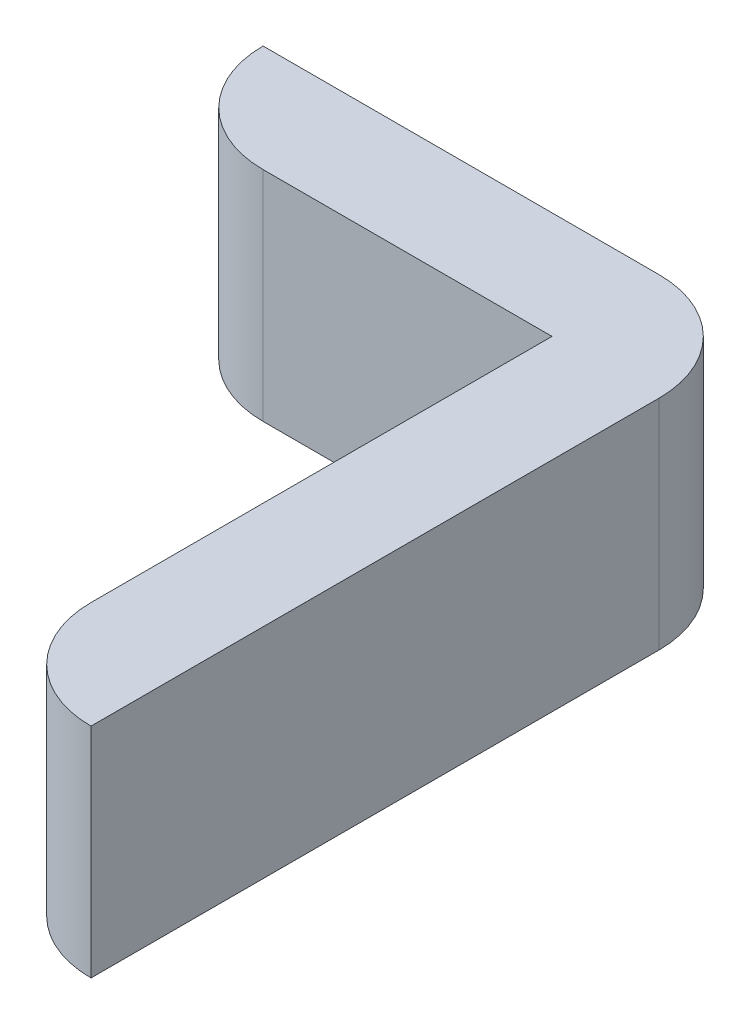
ISO-10303-21;
HEADER;
FILE_DESCRIPTION(('STEP AP214'),'2;1');
FILE_NAME('part.step','',(''),(''),'','','');
FILE_SCHEMA(('AUTOMOTIVE_DESIGN { 1 0 10303 214 1 1 1 1 }'));
ENDSEC;
DATA;
#1=APPLICATION_CONTEXT('core data for automotive mechanical design processes');
#2=APPLICATION_PROTOCOL_DEFINITION('international standard','automotive_design',2000,#1);
#3=PRODUCT_CONTEXT('',#1,'mechanical');
#4=PRODUCT('Part','Part','',(#3));
#5=PRODUCT_RELATED_PRODUCT_CATEGORY('part','',(#4));
#6=PRODUCT_DEFINITION_FORMATION('','',#4);
#7=PRODUCT_DEFINITION_CONTEXT('part definition',#1,'design');
#8=PRODUCT_DEFINITION('design','',#6,#7);
#9=PRODUCT_DEFINITION_SHAPE('','',#8);
#10=(LENGTH_UNIT() NAMED_UNIT(*) SI_UNIT(.MILLI.,.METRE.));
#11=(NAMED_UNIT(*) PLANE_ANGLE_UNIT() SI_UNIT($,.RADIAN.));
#12=(NAMED_UNIT(*) SI_UNIT($,.STERADIAN.) SOLID_ANGLE_UNIT());
#13=UNCERTAINTY_MEASURE_WITH_UNIT(LENGTH_MEASURE(1.E-05),#10,'distance_accuracy_value','');
#14=(GEOMETRIC_REPRESENTATION_CONTEXT(3) GLOBAL_UNCERTAINTY_ASSIGNED_CONTEXT((#13)) GLOBAL_UNIT_ASSIGNED_CONTEXT((#10,
#11,#12)) REPRESENTATION_CONTEXT('',''));
#15=CARTESIAN_POINT('',(0.,0.,0.));
#16=DIRECTION('',(0.,0.,1.));
#17=DIRECTION('',(1.,0.,0.));
#18=AXIS2_PLACEMENT_3D('',#15,#16,#17);
#19=CARTESIAN_POINT('',(9.275,7.8748,0.));
#20=DIRECTION('',(0.,-1.,0.));
#21=DIRECTION('',(0.,0.,-1.));
#22=AXIS2_PLACEMENT_3D('',#19,#20,#21);
#23=PLANE('',#22);
#24=DIRECTION('',(-1.,0.,0.));
#25=VECTOR('',#24,1.);
#26=CARTESIAN_POINT('',(9.525,7.8748,0.25));
#27=LINE('',#26,#25);
#28=CARTESIAN_POINT('',(9.525,7.8748,0.25));
#29=VERTEX_POINT('',#28);
#30=CARTESIAN_POINT('',(10.2,7.8748,0.25));
#31=VERTEX_POINT('',#30);
#32=EDGE_CURVE('E102',#29,#31,#27,.F.);
#33=ORIENTED_EDGE('',*,*,#32,.T.);
#34=DIRECTION('',(0.,0.,-1.));
#35=VECTOR('',#34,1.);
#36=CARTESIAN_POINT('',(10.2,7.8748,0.25));
#37=LINE('',#36,#35);
#38=CARTESIAN_POINT('',(10.2,7.8748,1.327));
#39=VERTEX_POINT('',#38);
#40=EDGE_CURVE('E108',#31,#39,#37,.F.);
#41=ORIENTED_EDGE('',*,*,#40,.T.);
#42=CARTESIAN_POINT('',(10.45,7.8748,1.327));
#43=DIRECTION('',(0.,-1.,0.));
#44=DIRECTION('',(0.,0.,-1.));
#45=AXIS2_PLACEMENT_3D('',#42,#43,#44);
#46=CIRCLE('',#45,0.25);
#47=CARTESIAN_POINT('',(10.45,7.8748,1.577));
#48=VERTEX_POINT('',#47);
#49=EDGE_CURVE('E80',#48,#39,#46,.T.);
#50=ORIENTED_EDGE('',*,*,#49,.F.);
#51=DIRECTION('',(0.,0.,1.));
#52=VECTOR('',#51,1.);
#53=CARTESIAN_POINT('',(10.45,7.8748,1.577));
#54=LINE('',#53,#52);
#55=CARTESIAN_POINT('',(10.45,7.8748,0.25));
#56=VERTEX_POINT('',#55);
#57=EDGE_CURVE('E75',#48,#56,#54,.F.);
#58=ORIENTED_EDGE('',*,*,#57,.T.);
#59=CARTESIAN_POINT('',(10.2,7.8748,0.25));
#60=DIRECTION('',(0.,-1.,0.));
#61=DIRECTION('',(0.,0.,-1.));
#62=AXIS2_PLACEMENT_3D('',#59,#60,#61);
#63=CIRCLE('',#62,0.25);
#64=CARTESIAN_POINT('',(10.2,7.8748,0.));
#65=VERTEX_POINT('',#64);
#66=EDGE_CURVE('E19',#65,#56,#63,.T.);
#67=ORIENTED_EDGE('',*,*,#66,.F.);
#68=DIRECTION('',(1.,0.,0.));
#69=VECTOR('',#68,1.);
#70=CARTESIAN_POINT('',(10.2,7.8748,0.));
#71=LINE('',#70,#69);
#72=CARTESIAN_POINT('',(9.275,7.8748,0.));
#73=VERTEX_POINT('',#72);
#74=EDGE_CURVE('E70',#65,#73,#71,.F.);
#75=ORIENTED_EDGE('',*,*,#74,.T.);
#76=CARTESIAN_POINT('',(9.525,7.8748,0.));
#77=DIRECTION('',(0.,-1.,0.));
#78=DIRECTION('',(0.,0.,-1.));
#79=AXIS2_PLACEMENT_3D('',#76,#77,#78);
#80=CIRCLE('',#79,0.25);
#81=EDGE_CURVE('E121',#29,#73,#80,.T.);
#82=ORIENTED_EDGE('',*,*,#81,.F.);
#83=EDGE_LOOP('',(#33,#41,#50,#58,#67,#75,#82));
#84=FACE_BOUND('',#83,.T.);
#85=ADVANCED_FACE('F16',(#84),#23,.F.);
#86=CARTESIAN_POINT('',(10.2,7.3652,0.));
#87=DIRECTION('',(0.,0.,1.));
#88=DIRECTION('',(1.,0.,0.));
#89=AXIS2_PLACEMENT_3D('',#86,#87,#88);
#90=PLANE('',#89);
#91=DIRECTION('',(0.,-1.,0.));
#92=VECTOR('',#91,1.);
#93=CARTESIAN_POINT('',(9.275,7.3652,0.));
#94=LINE('',#93,#92);
#95=CARTESIAN_POINT('',(9.275,7.3652,0.));
#96=VERTEX_POINT('',#95);
#97=EDGE_CURVE('E123',#73,#96,#94,.T.);
#98=ORIENTED_EDGE('',*,*,#97,.F.);
#99=ORIENTED_EDGE('',*,*,#74,.F.);
#100=DIRECTION('',(0.,-1.,0.));
#101=VECTOR('',#100,1.);
#102=CARTESIAN_POINT('',(10.2,7.3652,0.));
#103=LINE('',#102,#101);
#104=CARTESIAN_POINT('',(10.2,7.3652,0.));
#105=VERTEX_POINT('',#104);
#106=EDGE_CURVE('E92',#105,#65,#103,.F.);
#107=ORIENTED_EDGE('',*,*,#106,.F.);
#108=DIRECTION('',(1.,0.,0.));
#109=VECTOR('',#108,1.);
#110=CARTESIAN_POINT('',(9.275,7.3652,0.));
#111=LINE('',#110,#109);
#112=EDGE_CURVE('E120',#96,#105,#111,.T.);
#113=ORIENTED_EDGE('',*,*,#112,.F.);
#114=EDGE_LOOP('',(#98,#99,#107,#113));
#115=FACE_BOUND('',#114,.T.);
#116=ADVANCED_FACE('F158',(#115),#90,.F.);
#117=CARTESIAN_POINT('',(10.2,7.3652,0.25));
#118=DIRECTION('',(0.,-1.,0.));
#119=DIRECTION('',(0.,0.,-1.));
#120=AXIS2_PLACEMENT_3D('',#117,#118,#119);
#121=CYLINDRICAL_SURFACE('',#120,0.25);
#122=ORIENTED_EDGE('',*,*,#66,.T.);
#123=DIRECTION('',(0.,1.,0.));
#124=VECTOR('',#123,1.);
#125=CARTESIAN_POINT('',(10.45,7.3652,0.25));
#126=LINE('',#125,#124);
#127=CARTESIAN_POINT('',(10.45,7.3652,0.25));
#128=VERTEX_POINT('',#127);
#129=EDGE_CURVE('E86',#56,#128,#126,.F.);
#130=ORIENTED_EDGE('',*,*,#129,.T.);
#131=CARTESIAN_POINT('',(10.2,7.3652,0.25));
#132=DIRECTION('',(0.,-1.,0.));
#133=DIRECTION('',(0.,0.,-1.));
#134=AXIS2_PLACEMENT_3D('',#131,#132,#133);
#135=CIRCLE('',#134,0.25);
#136=EDGE_CURVE('E118',#105,#128,#135,.T.);
#137=ORIENTED_EDGE('',*,*,#136,.F.);
#138=ORIENTED_EDGE('',*,*,#106,.T.);
#139=EDGE_LOOP('',(#122,#130,#137,#138));
#140=FACE_BOUND('',#139,.T.);
#141=ADVANCED_FACE('F89',(#140),#121,.T.);
#142=CARTESIAN_POINT('',(10.45,7.3652,1.577));
#143=DIRECTION('',(-1.,0.,0.));
#144=DIRECTION('',(0.,0.,1.));
#145=AXIS2_PLACEMENT_3D('',#142,#143,#144);
#146=PLANE('',#145);
#147=DIRECTION('',(0.,-1.,0.));
#148=VECTOR('',#147,1.);
#149=CARTESIAN_POINT('',(10.45,7.3652,1.577));
#150=LINE('',#149,#148);
#151=CARTESIAN_POINT('',(10.45,7.3652,1.577));
#152=VERTEX_POINT('',#151);
#153=EDGE_CURVE('E85',#152,#48,#150,.F.);
#154=ORIENTED_EDGE('',*,*,#153,.F.);
#155=DIRECTION('',(0.,0.,-1.));
#156=VECTOR('',#155,1.);
#157=CARTESIAN_POINT('',(10.45,7.3652,0.));
#158=LINE('',#157,#156);
#159=EDGE_CURVE('E94',#128,#152,#158,.F.);
#160=ORIENTED_EDGE('',*,*,#159,.F.);
#161=ORIENTED_EDGE('',*,*,#129,.F.);
#162=ORIENTED_EDGE('',*,*,#57,.F.);
#163=EDGE_LOOP('',(#154,#160,#161,#162));
#164=FACE_BOUND('',#163,.T.);
#165=ADVANCED_FACE('F93',(#164),#146,.F.);
#166=CARTESIAN_POINT('',(10.45,7.3652,1.327));
#167=DIRECTION('',(0.,-1.,0.));
#168=DIRECTION('',(0.,0.,-1.));
#169=AXIS2_PLACEMENT_3D('',#166,#167,#168);
#170=CYLINDRICAL_SURFACE('',#169,0.25);
#171=ORIENTED_EDGE('',*,*,#49,.T.);
#172=DIRECTION('',(0.,1.,0.));
#173=VECTOR('',#172,1.);
#174=CARTESIAN_POINT('',(10.2,7.3652,1.327));
#175=LINE('',#174,#173);
#176=CARTESIAN_POINT('',(10.2,7.3652,1.327));
#177=VERTEX_POINT('',#176);
#178=EDGE_CURVE('E105',#39,#177,#175,.F.);
#179=ORIENTED_EDGE('',*,*,#178,.T.);
#180=CARTESIAN_POINT('',(10.45,7.3652,1.327));
#181=DIRECTION('',(0.,-1.,0.));
#182=DIRECTION('',(0.,0.,-1.));
#183=AXIS2_PLACEMENT_3D('',#180,#181,#182);
#184=CIRCLE('',#183,0.25);
#185=EDGE_CURVE('E114',#152,#177,#184,.T.);
#186=ORIENTED_EDGE('',*,*,#185,.F.);
#187=ORIENTED_EDGE('',*,*,#153,.T.);
#188=EDGE_LOOP('',(#171,#179,#186,#187));
#189=FACE_BOUND('',#188,.T.);
#190=ADVANCED_FACE('F127',(#189),#170,.T.);
#191=CARTESIAN_POINT('',(10.2,7.3652,0.25));
#192=DIRECTION('',(1.,0.,0.));
#193=DIRECTION('',(0.,0.,-1.));
#194=AXIS2_PLACEMENT_3D('',#191,#192,#193);
#195=PLANE('',#194);
#196=ORIENTED_EDGE('',*,*,#178,.F.);
#197=ORIENTED_EDGE('',*,*,#40,.F.);
#198=DIRECTION('',(0.,1.,0.));
#199=VECTOR('',#198,1.);
#200=CARTESIAN_POINT('',(10.2,7.3652,0.25));
#201=LINE('',#200,#199);
#202=CARTESIAN_POINT('',(10.2,7.3652,0.25));
#203=VERTEX_POINT('',#202);
#204=EDGE_CURVE('E104',#31,#203,#201,.F.);
#205=ORIENTED_EDGE('',*,*,#204,.T.);
#206=DIRECTION('',(0.,0.,-1.));
#207=VECTOR('',#206,1.);
#208=CARTESIAN_POINT('',(10.2,7.3652,0.));
#209=LINE('',#208,#207);
#210=EDGE_CURVE('E117',#177,#203,#209,.T.);
#211=ORIENTED_EDGE('',*,*,#210,.F.);
#212=EDGE_LOOP('',(#196,#197,#205,#211));
#213=FACE_BOUND('',#212,.T.);
#214=ADVANCED_FACE('F150',(#213),#195,.F.);
#215=CARTESIAN_POINT('',(9.525,7.3652,0.25));
#216=DIRECTION('',(0.,0.,-1.));
#217=DIRECTION('',(-1.,0.,0.));
#218=AXIS2_PLACEMENT_3D('',#215,#216,#217);
#219=PLANE('',#218);
#220=ORIENTED_EDGE('',*,*,#204,.F.);
#221=ORIENTED_EDGE('',*,*,#32,.F.);
#222=DIRECTION('',(0.,-1.,0.));
#223=VECTOR('',#222,1.);
#224=CARTESIAN_POINT('',(9.525,7.3652,0.25));
#225=LINE('',#224,#223);
#226=CARTESIAN_POINT('',(9.525,7.3652,0.25));
#227=VERTEX_POINT('',#226);
#228=EDGE_CURVE('E34',#227,#29,#225,.F.);
#229=ORIENTED_EDGE('',*,*,#228,.F.);
#230=DIRECTION('',(1.,0.,0.));
#231=VECTOR('',#230,1.);
#232=CARTESIAN_POINT('',(9.275,7.3652,0.25));
#233=LINE('',#232,#231);
#234=EDGE_CURVE('E25',#203,#227,#233,.F.);
#235=ORIENTED_EDGE('',*,*,#234,.F.);
#236=EDGE_LOOP('',(#220,#221,#229,#235));
#237=FACE_BOUND('',#236,.T.);
#238=ADVANCED_FACE('F151',(#237),#219,.F.);
#239=CARTESIAN_POINT('',(9.525,7.3652,0.));
#240=DIRECTION('',(0.,-1.,0.));
#241=DIRECTION('',(0.,0.,-1.));
#242=AXIS2_PLACEMENT_3D('',#239,#240,#241);
#243=CYLINDRICAL_SURFACE('',#242,0.25);
#244=ORIENTED_EDGE('',*,*,#81,.T.);
#245=ORIENTED_EDGE('',*,*,#97,.T.);
#246=CARTESIAN_POINT('',(9.525,7.3652,0.));
#247=DIRECTION('',(0.,-1.,0.));
#248=DIRECTION('',(0.,0.,-1.));
#249=AXIS2_PLACEMENT_3D('',#246,#247,#248);
#250=CIRCLE('',#249,0.25);
#251=EDGE_CURVE('E11',#227,#96,#250,.T.);
#252=ORIENTED_EDGE('',*,*,#251,.F.);
#253=ORIENTED_EDGE('',*,*,#228,.T.);
#254=EDGE_LOOP('',(#244,#245,#252,#253));
#255=FACE_BOUND('',#254,.T.);
#256=ADVANCED_FACE('F156',(#255),#243,.T.);
#257=CARTESIAN_POINT('',(9.275,7.3652,0.));
#258=DIRECTION('',(0.,-1.,0.));
#259=DIRECTION('',(0.,0.,-1.));
#260=AXIS2_PLACEMENT_3D('',#257,#258,#259);
#261=PLANE('',#260);
#262=ORIENTED_EDGE('',*,*,#234,.T.);
#263=ORIENTED_EDGE('',*,*,#251,.T.);
#264=ORIENTED_EDGE('',*,*,#112,.T.);
#265=ORIENTED_EDGE('',*,*,#136,.T.);
#266=ORIENTED_EDGE('',*,*,#159,.T.);
#267=ORIENTED_EDGE('',*,*,#185,.T.);
#268=ORIENTED_EDGE('',*,*,#210,.T.);
#269=EDGE_LOOP('',(#262,#263,#264,#265,#266,#267,#268));
#270=FACE_BOUND('',#269,.T.);
#271=ADVANCED_FACE('F132',(#270),#261,.T.);
#272=CLOSED_SHELL('',(#85,#116,#141,#165,#190,#214,#238,#256,#271));
#273=MANIFOLD_SOLID_BREP('B1',#272);
#274=ADVANCED_BREP_SHAPE_REPRESENTATION('',(#18,#273),#14);
#275=SHAPE_DEFINITION_REPRESENTATION(#9,#274);
ENDSEC;
END-ISO-10303-21;
